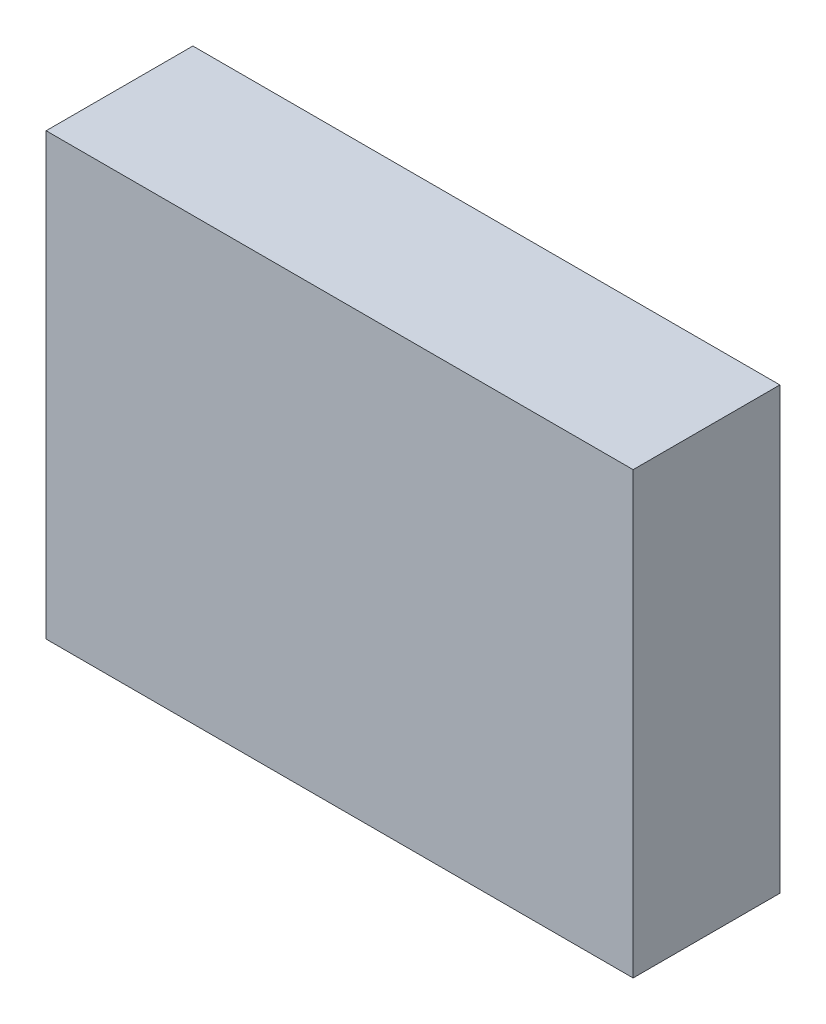
ISO-10303-21;
HEADER;
FILE_DESCRIPTION(('STEP AP214'),'2;1');
FILE_NAME('part.step','',(''),(''),'','','');
FILE_SCHEMA(('AUTOMOTIVE_DESIGN { 1 0 10303 214 1 1 1 1 }'));
ENDSEC;
DATA;
#1=APPLICATION_CONTEXT('core data for automotive mechanical design processes');
#2=APPLICATION_PROTOCOL_DEFINITION('international standard','automotive_design',2000,#1);
#3=PRODUCT_CONTEXT('',#1,'mechanical');
#4=PRODUCT('Part','Part','',(#3));
#5=PRODUCT_RELATED_PRODUCT_CATEGORY('part','',(#4));
#6=PRODUCT_DEFINITION_FORMATION('','',#4);
#7=PRODUCT_DEFINITION_CONTEXT('part definition',#1,'design');
#8=PRODUCT_DEFINITION('design','',#6,#7);
#9=PRODUCT_DEFINITION_SHAPE('','',#8);
#10=(LENGTH_UNIT() NAMED_UNIT(*) SI_UNIT(.MILLI.,.METRE.));
#11=(NAMED_UNIT(*) PLANE_ANGLE_UNIT() SI_UNIT($,.RADIAN.));
#12=(NAMED_UNIT(*) SI_UNIT($,.STERADIAN.) SOLID_ANGLE_UNIT());
#13=UNCERTAINTY_MEASURE_WITH_UNIT(LENGTH_MEASURE(1.E-05),#10,'distance_accuracy_value','');
#14=(GEOMETRIC_REPRESENTATION_CONTEXT(3) GLOBAL_UNCERTAINTY_ASSIGNED_CONTEXT((#13)) GLOBAL_UNIT_ASSIGNED_CONTEXT((#10,
#11,#12)) REPRESENTATION_CONTEXT('',''));
#15=CARTESIAN_POINT('',(0.,0.,0.));
#16=DIRECTION('',(0.,0.,1.));
#17=DIRECTION('',(1.,0.,0.));
#18=AXIS2_PLACEMENT_3D('',#15,#16,#17);
#19=CARTESIAN_POINT('',(-20.,0.,5.));
#20=DIRECTION('',(1.,0.,0.));
#21=DIRECTION('',(0.,0.,-1.));
#22=AXIS2_PLACEMENT_3D('',#19,#20,#21);
#23=PLANE('',#22);
#24=DIRECTION('',(0.,-1.,0.));
#25=VECTOR('',#24,1.);
#26=CARTESIAN_POINT('',(-20.,0.,-5.));
#27=LINE('',#26,#25);
#28=CARTESIAN_POINT('',(-20.,30.,-5.));
#29=VERTEX_POINT('',#28);
#30=CARTESIAN_POINT('',(-20.,0.,-5.));
#31=VERTEX_POINT('',#30);
#32=EDGE_CURVE('E96',#29,#31,#27,.T.);
#33=ORIENTED_EDGE('',*,*,#32,.T.);
#34=DIRECTION('',(0.,0.,-1.));
#35=VECTOR('',#34,1.);
#36=CARTESIAN_POINT('',(-20.,0.,5.));
#37=LINE('',#36,#35);
#38=CARTESIAN_POINT('',(-20.,0.,5.));
#39=VERTEX_POINT('',#38);
#40=EDGE_CURVE('E11',#39,#31,#37,.T.);
#41=ORIENTED_EDGE('',*,*,#40,.F.);
#42=DIRECTION('',(0.,-1.,0.));
#43=VECTOR('',#42,1.);
#44=CARTESIAN_POINT('',(-20.,0.,5.));
#45=LINE('',#44,#43);
#46=CARTESIAN_POINT('',(-20.,30.,5.));
#47=VERTEX_POINT('',#46);
#48=EDGE_CURVE('E84',#47,#39,#45,.T.);
#49=ORIENTED_EDGE('',*,*,#48,.F.);
#50=DIRECTION('',(0.,0.,-1.));
#51=VECTOR('',#50,1.);
#52=CARTESIAN_POINT('',(-20.,30.,5.));
#53=LINE('',#52,#51);
#54=EDGE_CURVE('E92',#47,#29,#53,.T.);
#55=ORIENTED_EDGE('',*,*,#54,.T.);
#56=EDGE_LOOP('',(#33,#41,#49,#55));
#57=FACE_BOUND('',#56,.T.);
#58=ADVANCED_FACE('F33',(#57),#23,.F.);
#59=CARTESIAN_POINT('',(-20.,0.,5.));
#60=DIRECTION('',(0.,1.,0.));
#61=DIRECTION('',(-1.,0.,0.));
#62=AXIS2_PLACEMENT_3D('',#59,#60,#61);
#63=PLANE('',#62);
#64=DIRECTION('',(1.,0.,0.));
#65=VECTOR('',#64,1.);
#66=CARTESIAN_POINT('',(-20.,0.,-5.));
#67=LINE('',#66,#65);
#68=CARTESIAN_POINT('',(20.,0.,-5.));
#69=VERTEX_POINT('',#68);
#70=EDGE_CURVE('E88',#31,#69,#67,.T.);
#71=ORIENTED_EDGE('',*,*,#70,.T.);
#72=DIRECTION('',(0.,0.,-1.));
#73=VECTOR('',#72,1.);
#74=CARTESIAN_POINT('',(20.,0.,5.));
#75=LINE('',#74,#73);
#76=CARTESIAN_POINT('',(20.,0.,5.));
#77=VERTEX_POINT('',#76);
#78=EDGE_CURVE('E41',#77,#69,#75,.T.);
#79=ORIENTED_EDGE('',*,*,#78,.F.);
#80=DIRECTION('',(1.,0.,0.));
#81=VECTOR('',#80,1.);
#82=CARTESIAN_POINT('',(-20.,0.,5.));
#83=LINE('',#82,#81);
#84=EDGE_CURVE('E79',#39,#77,#83,.T.);
#85=ORIENTED_EDGE('',*,*,#84,.F.);
#86=ORIENTED_EDGE('',*,*,#40,.T.);
#87=EDGE_LOOP('',(#71,#79,#85,#86));
#88=FACE_BOUND('',#87,.T.);
#89=ADVANCED_FACE('F87',(#88),#63,.F.);
#90=CARTESIAN_POINT('',(20.,0.,5.));
#91=DIRECTION('',(-1.,0.,0.));
#92=DIRECTION('',(0.,-1.,0.));
#93=AXIS2_PLACEMENT_3D('',#90,#91,#92);
#94=PLANE('',#93);
#95=DIRECTION('',(0.,1.,0.));
#96=VECTOR('',#95,1.);
#97=CARTESIAN_POINT('',(20.,0.,-5.));
#98=LINE('',#97,#96);
#99=CARTESIAN_POINT('',(20.,30.,-5.));
#100=VERTEX_POINT('',#99);
#101=EDGE_CURVE('E66',#69,#100,#98,.T.);
#102=ORIENTED_EDGE('',*,*,#101,.T.);
#103=DIRECTION('',(0.,0.,-1.));
#104=VECTOR('',#103,1.);
#105=CARTESIAN_POINT('',(20.,30.,5.));
#106=LINE('',#105,#104);
#107=CARTESIAN_POINT('',(20.,30.,5.));
#108=VERTEX_POINT('',#107);
#109=EDGE_CURVE('E89',#108,#100,#106,.T.);
#110=ORIENTED_EDGE('',*,*,#109,.F.);
#111=DIRECTION('',(0.,1.,0.));
#112=VECTOR('',#111,1.);
#113=CARTESIAN_POINT('',(20.,0.,5.));
#114=LINE('',#113,#112);
#115=EDGE_CURVE('E82',#77,#108,#114,.T.);
#116=ORIENTED_EDGE('',*,*,#115,.F.);
#117=ORIENTED_EDGE('',*,*,#78,.T.);
#118=EDGE_LOOP('',(#102,#110,#116,#117));
#119=FACE_BOUND('',#118,.T.);
#120=ADVANCED_FACE('F90',(#119),#94,.F.);
#121=CARTESIAN_POINT('',(-20.,30.,5.));
#122=DIRECTION('',(0.,-1.,0.));
#123=DIRECTION('',(0.,0.,-1.));
#124=AXIS2_PLACEMENT_3D('',#121,#122,#123);
#125=PLANE('',#124);
#126=DIRECTION('',(-1.,0.,0.));
#127=VECTOR('',#126,1.);
#128=CARTESIAN_POINT('',(-20.,30.,-5.));
#129=LINE('',#128,#127);
#130=EDGE_CURVE('E72',#100,#29,#129,.T.);
#131=ORIENTED_EDGE('',*,*,#130,.T.);
#132=ORIENTED_EDGE('',*,*,#54,.F.);
#133=DIRECTION('',(-1.,0.,0.));
#134=VECTOR('',#133,1.);
#135=CARTESIAN_POINT('',(-20.,30.,5.));
#136=LINE('',#135,#134);
#137=EDGE_CURVE('E49',#108,#47,#136,.T.);
#138=ORIENTED_EDGE('',*,*,#137,.F.);
#139=ORIENTED_EDGE('',*,*,#109,.T.);
#140=EDGE_LOOP('',(#131,#132,#138,#139));
#141=FACE_BOUND('',#140,.T.);
#142=ADVANCED_FACE('F103',(#141),#125,.F.);
#143=CARTESIAN_POINT('',(0.,0.,5.));
#144=DIRECTION('',(0.,0.,-1.));
#145=DIRECTION('',(-1.,0.,0.));
#146=AXIS2_PLACEMENT_3D('',#143,#144,#145);
#147=PLANE('',#146);
#148=ORIENTED_EDGE('',*,*,#48,.T.);
#149=ORIENTED_EDGE('',*,*,#84,.T.);
#150=ORIENTED_EDGE('',*,*,#115,.T.);
#151=ORIENTED_EDGE('',*,*,#137,.T.);
#152=EDGE_LOOP('',(#148,#149,#150,#151));
#153=FACE_BOUND('',#152,.T.);
#154=ADVANCED_FACE('F80',(#153),#147,.F.);
#155=CARTESIAN_POINT('',(0.,0.,-5.));
#156=DIRECTION('',(0.,0.,-1.));
#157=DIRECTION('',(-1.,0.,0.));
#158=AXIS2_PLACEMENT_3D('',#155,#156,#157);
#159=PLANE('',#158);
#160=ORIENTED_EDGE('',*,*,#32,.F.);
#161=ORIENTED_EDGE('',*,*,#130,.F.);
#162=ORIENTED_EDGE('',*,*,#101,.F.);
#163=ORIENTED_EDGE('',*,*,#70,.F.);
#164=EDGE_LOOP('',(#160,#161,#162,#163));
#165=FACE_BOUND('',#164,.T.);
#166=ADVANCED_FACE('F106',(#165),#159,.T.);
#167=CLOSED_SHELL('',(#58,#89,#120,#142,#154,#166));
#168=MANIFOLD_SOLID_BREP('B2',#167);
#169=ADVANCED_BREP_SHAPE_REPRESENTATION('',(#18,#168),#14);
#170=SHAPE_DEFINITION_REPRESENTATION(#9,#169);
ENDSEC;
END-ISO-10303-21;
